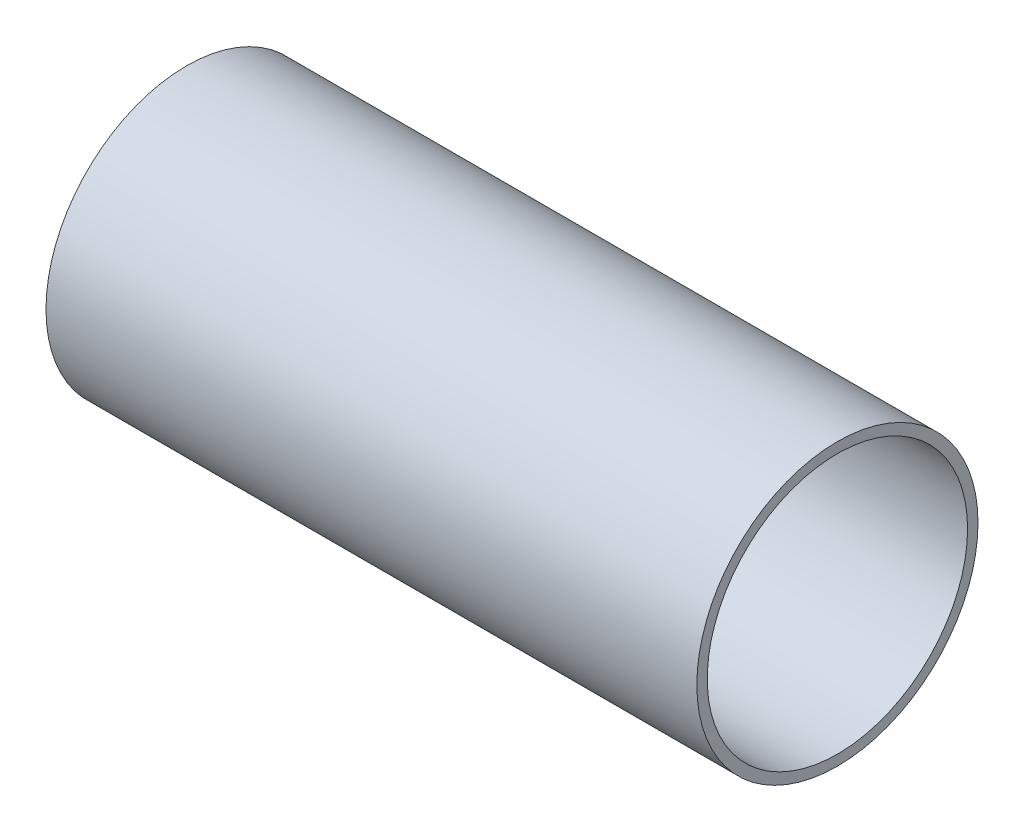
ISO-10303-21;
HEADER;
FILE_DESCRIPTION(('STEP AP214'),'2;1');
FILE_NAME('part.step','',(''),(''),'','','');
FILE_SCHEMA(('AUTOMOTIVE_DESIGN { 1 0 10303 214 1 1 1 1 }'));
ENDSEC;
DATA;
#1=APPLICATION_CONTEXT('core data for automotive mechanical design processes');
#2=APPLICATION_PROTOCOL_DEFINITION('international standard','automotive_design',2000,#1);
#3=PRODUCT_CONTEXT('',#1,'mechanical');
#4=PRODUCT('Part','Part','',(#3));
#5=PRODUCT_RELATED_PRODUCT_CATEGORY('part','',(#4));
#6=PRODUCT_DEFINITION_FORMATION('','',#4);
#7=PRODUCT_DEFINITION_CONTEXT('part definition',#1,'design');
#8=PRODUCT_DEFINITION('design','',#6,#7);
#9=PRODUCT_DEFINITION_SHAPE('','',#8);
#10=(LENGTH_UNIT() NAMED_UNIT(*) SI_UNIT(.MILLI.,.METRE.));
#11=(NAMED_UNIT(*) PLANE_ANGLE_UNIT() SI_UNIT($,.RADIAN.));
#12=(NAMED_UNIT(*) SI_UNIT($,.STERADIAN.) SOLID_ANGLE_UNIT());
#13=UNCERTAINTY_MEASURE_WITH_UNIT(LENGTH_MEASURE(1.E-05),#10,'distance_accuracy_value','');
#14=(GEOMETRIC_REPRESENTATION_CONTEXT(3) GLOBAL_UNCERTAINTY_ASSIGNED_CONTEXT((#13)) GLOBAL_UNIT_ASSIGNED_CONTEXT((#10,
#11,#12)) REPRESENTATION_CONTEXT('',''));
#15=CARTESIAN_POINT('',(0.,0.,0.));
#16=DIRECTION('',(0.,0.,1.));
#17=DIRECTION('',(1.,0.,0.));
#18=AXIS2_PLACEMENT_3D('',#15,#16,#17);
#19=CARTESIAN_POINT('',(125.,0.,0.));
#20=DIRECTION('',(1.,0.,0.));
#21=DIRECTION('',(0.,0.,-1.));
#22=AXIS2_PLACEMENT_3D('',#19,#20,#21);
#23=PLANE('',#22);
#24=CARTESIAN_POINT('',(125.,0.,0.));
#25=DIRECTION('',(1.,0.,0.));
#26=DIRECTION('',(0.,0.,-1.));
#27=AXIS2_PLACEMENT_3D('',#24,#25,#26);
#28=CIRCLE('',#27,27.);
#29=CARTESIAN_POINT('',(125.,0.,-27.));
#30=VERTEX_POINT('',#29);
#31=EDGE_CURVE('E10',#30,#30,#28,.T.);
#32=ORIENTED_EDGE('',*,*,#31,.T.);
#33=EDGE_LOOP('',(#32));
#34=FACE_BOUND('',#33,.T.);
#35=CARTESIAN_POINT('',(125.,0.,0.));
#36=DIRECTION('',(1.,0.,0.));
#37=DIRECTION('',(0.,0.,-1.));
#38=AXIS2_PLACEMENT_3D('',#35,#36,#37);
#39=CIRCLE('',#38,25.);
#40=CARTESIAN_POINT('',(125.,0.,-25.));
#41=VERTEX_POINT('',#40);
#42=EDGE_CURVE('E46',#41,#41,#39,.T.);
#43=ORIENTED_EDGE('',*,*,#42,.F.);
#44=EDGE_LOOP('',(#43));
#45=FACE_BOUND('',#44,.T.);
#46=ADVANCED_FACE('F35',(#34,#45),#23,.T.);
#47=CARTESIAN_POINT('',(0.,0.,0.));
#48=DIRECTION('',(1.,0.,0.));
#49=DIRECTION('',(0.,0.,-1.));
#50=AXIS2_PLACEMENT_3D('',#47,#48,#49);
#51=PLANE('',#50);
#52=CARTESIAN_POINT('',(0.,0.,0.));
#53=DIRECTION('',(1.,0.,0.));
#54=DIRECTION('',(0.,0.,-1.));
#55=AXIS2_PLACEMENT_3D('',#52,#53,#54);
#56=CIRCLE('',#55,27.);
#57=CARTESIAN_POINT('',(0.,0.,-27.));
#58=VERTEX_POINT('',#57);
#59=EDGE_CURVE('E39',#58,#58,#56,.T.);
#60=ORIENTED_EDGE('',*,*,#59,.F.);
#61=EDGE_LOOP('',(#60));
#62=FACE_BOUND('',#61,.T.);
#63=CARTESIAN_POINT('',(0.,0.,0.));
#64=DIRECTION('',(1.,0.,0.));
#65=DIRECTION('',(0.,0.,-1.));
#66=AXIS2_PLACEMENT_3D('',#63,#64,#65);
#67=CIRCLE('',#66,25.);
#68=CARTESIAN_POINT('',(0.,0.,-25.));
#69=VERTEX_POINT('',#68);
#70=EDGE_CURVE('E48',#69,#69,#67,.T.);
#71=ORIENTED_EDGE('',*,*,#70,.T.);
#72=EDGE_LOOP('',(#71));
#73=FACE_BOUND('',#72,.T.);
#74=ADVANCED_FACE('F58',(#62,#73),#51,.F.);
#75=CARTESIAN_POINT('',(125.,0.,0.));
#76=DIRECTION('',(-1.,0.,0.));
#77=DIRECTION('',(0.,0.,1.));
#78=AXIS2_PLACEMENT_3D('',#75,#76,#77);
#79=CYLINDRICAL_SURFACE('',#78,27.);
#80=ORIENTED_EDGE('',*,*,#31,.F.);
#81=EDGE_LOOP('',(#80));
#82=FACE_BOUND('',#81,.T.);
#83=ORIENTED_EDGE('',*,*,#59,.T.);
#84=EDGE_LOOP('',(#83));
#85=FACE_BOUND('',#84,.T.);
#86=ADVANCED_FACE('F37',(#82,#85),#79,.T.);
#87=CARTESIAN_POINT('',(125.,0.,0.));
#88=DIRECTION('',(-1.,0.,0.));
#89=DIRECTION('',(0.,0.,1.));
#90=AXIS2_PLACEMENT_3D('',#87,#88,#89);
#91=CYLINDRICAL_SURFACE('',#90,25.);
#92=ORIENTED_EDGE('',*,*,#42,.T.);
#93=EDGE_LOOP('',(#92));
#94=FACE_BOUND('',#93,.T.);
#95=ORIENTED_EDGE('',*,*,#70,.F.);
#96=EDGE_LOOP('',(#95));
#97=FACE_BOUND('',#96,.T.);
#98=ADVANCED_FACE('F54',(#94,#97),#91,.F.);
#99=CLOSED_SHELL('',(#46,#74,#86,#98));
#100=MANIFOLD_SOLID_BREP('B2',#99);
#101=ADVANCED_BREP_SHAPE_REPRESENTATION('',(#18,#100),#14);
#102=SHAPE_DEFINITION_REPRESENTATION(#9,#101);
ENDSEC;
END-ISO-10303-21;
